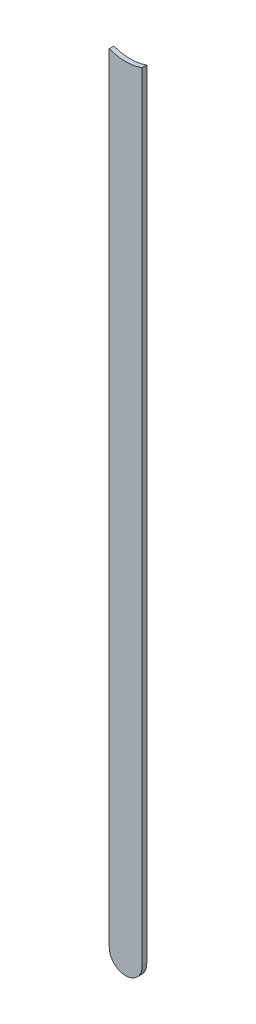
ISO-10303-21;
HEADER;
FILE_DESCRIPTION(('STEP AP214'),'2;1');
FILE_NAME('part.step','',(''),(''),'','','');
FILE_SCHEMA(('AUTOMOTIVE_DESIGN { 1 0 10303 214 1 1 1 1 }'));
ENDSEC;
DATA;
#1=APPLICATION_CONTEXT('core data for automotive mechanical design processes');
#2=APPLICATION_PROTOCOL_DEFINITION('international standard','automotive_design',2000,#1);
#3=PRODUCT_CONTEXT('',#1,'mechanical');
#4=PRODUCT('Part','Part','',(#3));
#5=PRODUCT_RELATED_PRODUCT_CATEGORY('part','',(#4));
#6=PRODUCT_DEFINITION_FORMATION('','',#4);
#7=PRODUCT_DEFINITION_CONTEXT('part definition',#1,'design');
#8=PRODUCT_DEFINITION('design','',#6,#7);
#9=PRODUCT_DEFINITION_SHAPE('','',#8);
#10=(LENGTH_UNIT() NAMED_UNIT(*) SI_UNIT(.MILLI.,.METRE.));
#11=(NAMED_UNIT(*) PLANE_ANGLE_UNIT() SI_UNIT($,.RADIAN.));
#12=(NAMED_UNIT(*) SI_UNIT($,.STERADIAN.) SOLID_ANGLE_UNIT());
#13=UNCERTAINTY_MEASURE_WITH_UNIT(LENGTH_MEASURE(1.E-05),#10,'distance_accuracy_value','');
#14=(GEOMETRIC_REPRESENTATION_CONTEXT(3) GLOBAL_UNCERTAINTY_ASSIGNED_CONTEXT((#13)) GLOBAL_UNIT_ASSIGNED_CONTEXT((#10,
#11,#12)) REPRESENTATION_CONTEXT('',''));
#15=CARTESIAN_POINT('',(0.,0.,0.));
#16=DIRECTION('',(0.,0.,1.));
#17=DIRECTION('',(1.,0.,0.));
#18=AXIS2_PLACEMENT_3D('',#15,#16,#17);
#19=CARTESIAN_POINT('',(85.643974,95.9480428,0.));
#20=DIRECTION('',(-1.,0.,0.));
#21=DIRECTION('',(0.,1.,0.));
#22=AXIS2_PLACEMENT_3D('',#19,#20,#21);
#23=PLANE('',#22);
#24=DIRECTION('',(0.,1.,0.));
#25=VECTOR('',#24,1.);
#26=CARTESIAN_POINT('',(85.643974,95.9480428,0.03556));
#27=LINE('',#26,#25);
#28=CARTESIAN_POINT('',(85.643974,95.9480428,0.03556));
#29=VERTEX_POINT('',#28);
#30=CARTESIAN_POINT('',(85.643974,101.954825380502,0.03556));
#31=VERTEX_POINT('',#30);
#32=EDGE_CURVE('E11',#29,#31,#27,.T.);
#33=ORIENTED_EDGE('',*,*,#32,.F.);
#34=DIRECTION('',(0.,0.,1.));
#35=VECTOR('',#34,1.);
#36=CARTESIAN_POINT('',(85.643974,95.9480428,0.));
#37=LINE('',#36,#35);
#38=CARTESIAN_POINT('',(85.643974,95.9480428,0.));
#39=VERTEX_POINT('',#38);
#40=EDGE_CURVE('E24',#39,#29,#37,.T.);
#41=ORIENTED_EDGE('',*,*,#40,.F.);
#42=DIRECTION('',(0.,1.,0.));
#43=VECTOR('',#42,1.);
#44=CARTESIAN_POINT('',(85.643974,95.9480428,0.));
#45=LINE('',#44,#43);
#46=CARTESIAN_POINT('',(85.643974,101.954825380502,0.));
#47=VERTEX_POINT('',#46);
#48=EDGE_CURVE('E75',#39,#47,#45,.T.);
#49=ORIENTED_EDGE('',*,*,#48,.T.);
#50=DIRECTION('',(0.,0.,1.));
#51=VECTOR('',#50,1.);
#52=CARTESIAN_POINT('',(85.643974,101.954825380502,0.));
#53=LINE('',#52,#51);
#54=EDGE_CURVE('E37',#47,#31,#53,.T.);
#55=ORIENTED_EDGE('',*,*,#54,.T.);
#56=EDGE_LOOP('',(#33,#41,#49,#55));
#57=FACE_BOUND('',#56,.T.);
#58=ADVANCED_FACE('F17',(#57),#23,.F.);
#59=CARTESIAN_POINT('',(85.516974,102.28697348,0.));
#60=DIRECTION('',(0.,0.,-1.));
#61=DIRECTION('',(1.,0.,0.));
#62=AXIS2_PLACEMENT_3D('',#59,#60,#61);
#63=CYLINDRICAL_SURFACE('',#62,0.3556);
#64=DIRECTION('',(0.,0.,1.));
#65=VECTOR('',#64,1.);
#66=CARTESIAN_POINT('',(85.389974,101.954825380502,0.));
#67=LINE('',#66,#65);
#68=CARTESIAN_POINT('',(85.389974,101.954825380502,0.));
#69=VERTEX_POINT('',#68);
#70=CARTESIAN_POINT('',(85.389974,101.954825380502,0.03556));
#71=VERTEX_POINT('',#70);
#72=EDGE_CURVE('E67',#69,#71,#67,.T.);
#73=ORIENTED_EDGE('',*,*,#72,.T.);
#74=CARTESIAN_POINT('',(85.516974,102.28697348,0.03556));
#75=DIRECTION('',(0.,0.,1.));
#76=DIRECTION('',(1.,0.,0.));
#77=AXIS2_PLACEMENT_3D('',#74,#75,#76);
#78=CIRCLE('',#77,0.3556);
#79=EDGE_CURVE('E82',#71,#31,#78,.T.);
#80=ORIENTED_EDGE('',*,*,#79,.T.);
#81=ORIENTED_EDGE('',*,*,#54,.F.);
#82=CARTESIAN_POINT('',(85.516974,102.28697348,0.));
#83=DIRECTION('',(0.,0.,1.));
#84=DIRECTION('',(1.,0.,0.));
#85=AXIS2_PLACEMENT_3D('',#82,#83,#84);
#86=CIRCLE('',#85,0.3556);
#87=EDGE_CURVE('E80',#69,#47,#86,.T.);
#88=ORIENTED_EDGE('',*,*,#87,.F.);
#89=EDGE_LOOP('',(#73,#80,#81,#88));
#90=FACE_BOUND('',#89,.T.);
#91=ADVANCED_FACE('F88',(#90),#63,.F.);
#92=CARTESIAN_POINT('',(85.389974,101.954825380502,0.));
#93=DIRECTION('',(1.,0.,0.));
#94=DIRECTION('',(0.,-1.,0.));
#95=AXIS2_PLACEMENT_3D('',#92,#93,#94);
#96=PLANE('',#95);
#97=DIRECTION('',(0.,-1.,0.));
#98=VECTOR('',#97,1.);
#99=CARTESIAN_POINT('',(85.389974,102.28697348,0.03556));
#100=LINE('',#99,#98);
#101=CARTESIAN_POINT('',(85.389974,95.9480428,0.03556));
#102=VERTEX_POINT('',#101);
#103=EDGE_CURVE('E71',#71,#102,#100,.T.);
#104=ORIENTED_EDGE('',*,*,#103,.F.);
#105=ORIENTED_EDGE('',*,*,#72,.F.);
#106=DIRECTION('',(0.,-1.,0.));
#107=VECTOR('',#106,1.);
#108=CARTESIAN_POINT('',(85.389974,102.28697348,0.));
#109=LINE('',#108,#107);
#110=CARTESIAN_POINT('',(85.389974,95.9480428,0.));
#111=VERTEX_POINT('',#110);
#112=EDGE_CURVE('E63',#69,#111,#109,.T.);
#113=ORIENTED_EDGE('',*,*,#112,.T.);
#114=DIRECTION('',(0.,0.,1.));
#115=VECTOR('',#114,1.);
#116=CARTESIAN_POINT('',(85.389974,95.9480428,0.));
#117=LINE('',#116,#115);
#118=EDGE_CURVE('E53',#111,#102,#117,.T.);
#119=ORIENTED_EDGE('',*,*,#118,.T.);
#120=EDGE_LOOP('',(#104,#105,#113,#119));
#121=FACE_BOUND('',#120,.T.);
#122=ADVANCED_FACE('F66',(#121),#96,.F.);
#123=CARTESIAN_POINT('',(85.516974,95.9480428,0.));
#124=DIRECTION('',(0.,0.,-1.));
#125=DIRECTION('',(-1.,0.,0.));
#126=AXIS2_PLACEMENT_3D('',#123,#124,#125);
#127=CYLINDRICAL_SURFACE('',#126,0.127);
#128=CARTESIAN_POINT('',(85.516974,95.9480428,0.03556));
#129=DIRECTION('',(0.,0.,1.));
#130=DIRECTION('',(-1.,0.,0.));
#131=AXIS2_PLACEMENT_3D('',#128,#129,#130);
#132=CIRCLE('',#131,0.127);
#133=EDGE_CURVE('E59',#102,#29,#132,.T.);
#134=ORIENTED_EDGE('',*,*,#133,.F.);
#135=ORIENTED_EDGE('',*,*,#118,.F.);
#136=CARTESIAN_POINT('',(85.516974,95.9480428,0.));
#137=DIRECTION('',(0.,0.,1.));
#138=DIRECTION('',(-1.,0.,0.));
#139=AXIS2_PLACEMENT_3D('',#136,#137,#138);
#140=CIRCLE('',#139,0.127);
#141=EDGE_CURVE('E57',#111,#39,#140,.T.);
#142=ORIENTED_EDGE('',*,*,#141,.T.);
#143=ORIENTED_EDGE('',*,*,#40,.T.);
#144=EDGE_LOOP('',(#134,#135,#142,#143));
#145=FACE_BOUND('',#144,.T.);
#146=ADVANCED_FACE('F55',(#145),#127,.T.);
#147=CARTESIAN_POINT('',(85.643974,95.9480428,0.));
#148=DIRECTION('',(0.,0.,-1.));
#149=DIRECTION('',(-1.,0.,0.));
#150=AXIS2_PLACEMENT_3D('',#147,#148,#149);
#151=PLANE('',#150);
#152=ORIENTED_EDGE('',*,*,#48,.F.);
#153=ORIENTED_EDGE('',*,*,#141,.F.);
#154=ORIENTED_EDGE('',*,*,#112,.F.);
#155=ORIENTED_EDGE('',*,*,#87,.T.);
#156=EDGE_LOOP('',(#152,#153,#154,#155));
#157=FACE_BOUND('',#156,.T.);
#158=ADVANCED_FACE('F74',(#157),#151,.T.);
#159=CARTESIAN_POINT('',(85.643974,95.9480428,0.03556));
#160=DIRECTION('',(0.,0.,-1.));
#161=DIRECTION('',(-1.,0.,0.));
#162=AXIS2_PLACEMENT_3D('',#159,#160,#161);
#163=PLANE('',#162);
#164=ORIENTED_EDGE('',*,*,#133,.T.);
#165=ORIENTED_EDGE('',*,*,#32,.T.);
#166=ORIENTED_EDGE('',*,*,#79,.F.);
#167=ORIENTED_EDGE('',*,*,#103,.T.);
#168=EDGE_LOOP('',(#164,#165,#166,#167));
#169=FACE_BOUND('',#168,.T.);
#170=ADVANCED_FACE('F91',(#169),#163,.F.);
#171=CLOSED_SHELL('',(#58,#91,#122,#146,#158,#170));
#172=MANIFOLD_SOLID_BREP('B1',#171);
#173=ADVANCED_BREP_SHAPE_REPRESENTATION('',(#18,#172),#14);
#174=SHAPE_DEFINITION_REPRESENTATION(#9,#173);
ENDSEC;
END-ISO-10303-21;
